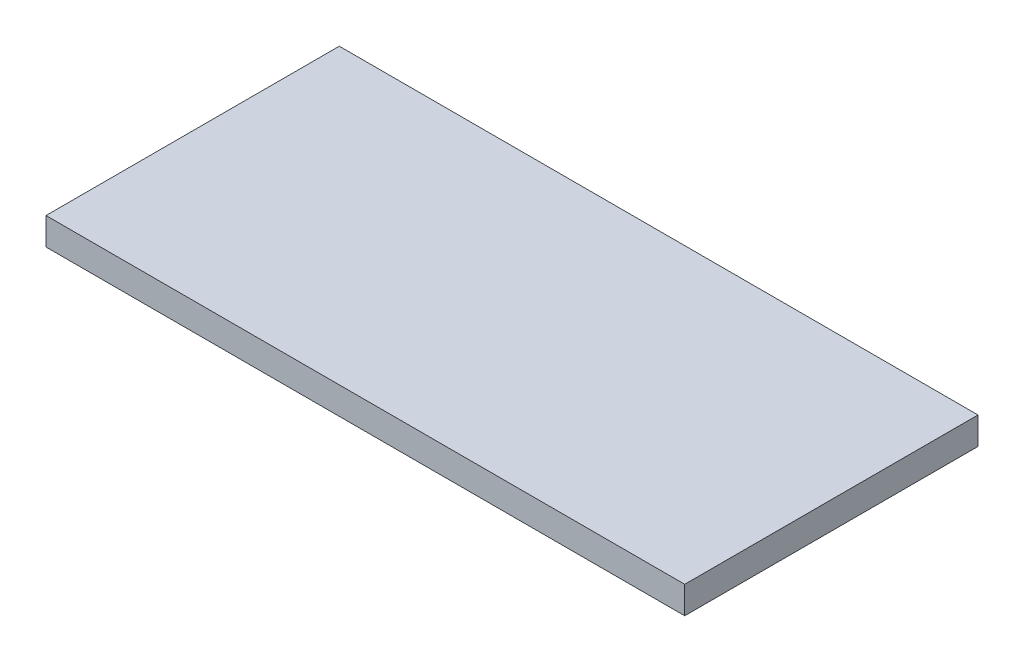
ISO-10303-21;
HEADER;
FILE_DESCRIPTION(('STEP AP214'),'2;1');
FILE_NAME('part.step','',(''),(''),'','','');
FILE_SCHEMA(('AUTOMOTIVE_DESIGN { 1 0 10303 214 1 1 1 1 }'));
ENDSEC;
DATA;
#1=APPLICATION_CONTEXT('core data for automotive mechanical design processes');
#2=APPLICATION_PROTOCOL_DEFINITION('international standard','automotive_design',2000,#1);
#3=PRODUCT_CONTEXT('',#1,'mechanical');
#4=PRODUCT('Part','Part','',(#3));
#5=PRODUCT_RELATED_PRODUCT_CATEGORY('part','',(#4));
#6=PRODUCT_DEFINITION_FORMATION('','',#4);
#7=PRODUCT_DEFINITION_CONTEXT('part definition',#1,'design');
#8=PRODUCT_DEFINITION('design','',#6,#7);
#9=PRODUCT_DEFINITION_SHAPE('','',#8);
#10=(LENGTH_UNIT() NAMED_UNIT(*) SI_UNIT(.MILLI.,.METRE.));
#11=(NAMED_UNIT(*) PLANE_ANGLE_UNIT() SI_UNIT($,.RADIAN.));
#12=(NAMED_UNIT(*) SI_UNIT($,.STERADIAN.) SOLID_ANGLE_UNIT());
#13=UNCERTAINTY_MEASURE_WITH_UNIT(LENGTH_MEASURE(1.E-05),#10,'distance_accuracy_value','');
#14=(GEOMETRIC_REPRESENTATION_CONTEXT(3) GLOBAL_UNCERTAINTY_ASSIGNED_CONTEXT((#13)) GLOBAL_UNIT_ASSIGNED_CONTEXT((#10,
#11,#12)) REPRESENTATION_CONTEXT('',''));
#15=CARTESIAN_POINT('',(0.,0.,0.));
#16=DIRECTION('',(0.,0.,1.));
#17=DIRECTION('',(1.,0.,0.));
#18=AXIS2_PLACEMENT_3D('',#15,#16,#17);
#19=CARTESIAN_POINT('',(0.,1.56,0.));
#20=DIRECTION('',(0.,0.,-1.));
#21=DIRECTION('',(-1.,0.,0.));
#22=AXIS2_PLACEMENT_3D('',#19,#20,#21);
#23=PLANE('',#22);
#24=DIRECTION('',(1.,0.,0.));
#25=VECTOR('',#24,1.);
#26=CARTESIAN_POINT('',(0.,0.,0.));
#27=LINE('',#26,#25);
#28=CARTESIAN_POINT('',(0.,0.,0.));
#29=VERTEX_POINT('',#28);
#30=CARTESIAN_POINT('',(36.5,0.,0.));
#31=VERTEX_POINT('',#30);
#32=EDGE_CURVE('E96',#29,#31,#27,.T.);
#33=ORIENTED_EDGE('',*,*,#32,.T.);
#34=DIRECTION('',(0.,-1.,0.));
#35=VECTOR('',#34,1.);
#36=CARTESIAN_POINT('',(36.5,1.56,0.));
#37=LINE('',#36,#35);
#38=CARTESIAN_POINT('',(36.5,1.56,0.));
#39=VERTEX_POINT('',#38);
#40=EDGE_CURVE('E11',#39,#31,#37,.T.);
#41=ORIENTED_EDGE('',*,*,#40,.F.);
#42=DIRECTION('',(1.,0.,0.));
#43=VECTOR('',#42,1.);
#44=CARTESIAN_POINT('',(0.,1.56,0.));
#45=LINE('',#44,#43);
#46=CARTESIAN_POINT('',(0.,1.56,0.));
#47=VERTEX_POINT('',#46);
#48=EDGE_CURVE('E82',#47,#39,#45,.T.);
#49=ORIENTED_EDGE('',*,*,#48,.F.);
#50=DIRECTION('',(0.,-1.,0.));
#51=VECTOR('',#50,1.);
#52=CARTESIAN_POINT('',(0.,1.56,0.));
#53=LINE('',#52,#51);
#54=EDGE_CURVE('E49',#47,#29,#53,.T.);
#55=ORIENTED_EDGE('',*,*,#54,.T.);
#56=EDGE_LOOP('',(#33,#41,#49,#55));
#57=FACE_BOUND('',#56,.T.);
#58=ADVANCED_FACE('F33',(#57),#23,.F.);
#59=CARTESIAN_POINT('',(36.5,1.56,0.));
#60=DIRECTION('',(-1.,0.,0.));
#61=DIRECTION('',(0.,0.,1.));
#62=AXIS2_PLACEMENT_3D('',#59,#60,#61);
#63=PLANE('',#62);
#64=DIRECTION('',(0.,0.,-1.));
#65=VECTOR('',#64,1.);
#66=CARTESIAN_POINT('',(36.5,0.,0.));
#67=LINE('',#66,#65);
#68=CARTESIAN_POINT('',(36.5,0.,-16.76));
#69=VERTEX_POINT('',#68);
#70=EDGE_CURVE('E87',#31,#69,#67,.T.);
#71=ORIENTED_EDGE('',*,*,#70,.T.);
#72=DIRECTION('',(0.,-1.,0.));
#73=VECTOR('',#72,1.);
#74=CARTESIAN_POINT('',(36.5,1.56,-16.76));
#75=LINE('',#74,#73);
#76=CARTESIAN_POINT('',(36.5,1.56,-16.76));
#77=VERTEX_POINT('',#76);
#78=EDGE_CURVE('E41',#77,#69,#75,.T.);
#79=ORIENTED_EDGE('',*,*,#78,.F.);
#80=DIRECTION('',(0.,0.,-1.));
#81=VECTOR('',#80,1.);
#82=CARTESIAN_POINT('',(36.5,1.56,0.));
#83=LINE('',#82,#81);
#84=EDGE_CURVE('E74',#39,#77,#83,.T.);
#85=ORIENTED_EDGE('',*,*,#84,.F.);
#86=ORIENTED_EDGE('',*,*,#40,.T.);
#87=EDGE_LOOP('',(#71,#79,#85,#86));
#88=FACE_BOUND('',#87,.T.);
#89=ADVANCED_FACE('F86',(#88),#63,.F.);
#90=CARTESIAN_POINT('',(0.,1.56,-16.76));
#91=DIRECTION('',(0.,0.,-1.));
#92=DIRECTION('',(-1.,0.,0.));
#93=AXIS2_PLACEMENT_3D('',#90,#91,#92);
#94=PLANE('',#93);
#95=DIRECTION('',(1.,0.,0.));
#96=VECTOR('',#95,1.);
#97=CARTESIAN_POINT('',(0.,0.,-16.76));
#98=LINE('',#97,#96);
#99=CARTESIAN_POINT('',(0.,0.,-16.76));
#100=VERTEX_POINT('',#99);
#101=EDGE_CURVE('E99',#100,#69,#98,.T.);
#102=ORIENTED_EDGE('',*,*,#101,.F.);
#103=DIRECTION('',(0.,-1.,0.));
#104=VECTOR('',#103,1.);
#105=CARTESIAN_POINT('',(0.,1.56,-16.76));
#106=LINE('',#105,#104);
#107=CARTESIAN_POINT('',(0.,1.56,-16.76));
#108=VERTEX_POINT('',#107);
#109=EDGE_CURVE('E63',#108,#100,#106,.T.);
#110=ORIENTED_EDGE('',*,*,#109,.F.);
#111=DIRECTION('',(1.,0.,0.));
#112=VECTOR('',#111,1.);
#113=CARTESIAN_POINT('',(0.,1.56,-16.76));
#114=LINE('',#113,#112);
#115=EDGE_CURVE('E81',#108,#77,#114,.T.);
#116=ORIENTED_EDGE('',*,*,#115,.T.);
#117=ORIENTED_EDGE('',*,*,#78,.T.);
#118=EDGE_LOOP('',(#102,#110,#116,#117));
#119=FACE_BOUND('',#118,.T.);
#120=ADVANCED_FACE('F90',(#119),#94,.T.);
#121=CARTESIAN_POINT('',(0.,1.56,0.));
#122=DIRECTION('',(-1.,0.,0.));
#123=DIRECTION('',(0.,0.,1.));
#124=AXIS2_PLACEMENT_3D('',#121,#122,#123);
#125=PLANE('',#124);
#126=DIRECTION('',(0.,0.,-1.));
#127=VECTOR('',#126,1.);
#128=CARTESIAN_POINT('',(0.,0.,0.));
#129=LINE('',#128,#127);
#130=EDGE_CURVE('E101',#29,#100,#129,.T.);
#131=ORIENTED_EDGE('',*,*,#130,.F.);
#132=ORIENTED_EDGE('',*,*,#54,.F.);
#133=DIRECTION('',(0.,0.,-1.));
#134=VECTOR('',#133,1.);
#135=CARTESIAN_POINT('',(0.,1.56,0.));
#136=LINE('',#135,#134);
#137=EDGE_CURVE('E91',#47,#108,#136,.T.);
#138=ORIENTED_EDGE('',*,*,#137,.T.);
#139=ORIENTED_EDGE('',*,*,#109,.T.);
#140=EDGE_LOOP('',(#131,#132,#138,#139));
#141=FACE_BOUND('',#140,.T.);
#142=ADVANCED_FACE('F107',(#141),#125,.T.);
#143=CARTESIAN_POINT('',(0.,1.56,0.));
#144=DIRECTION('',(0.,1.,0.));
#145=DIRECTION('',(0.,0.,1.));
#146=AXIS2_PLACEMENT_3D('',#143,#144,#145);
#147=PLANE('',#146);
#148=ORIENTED_EDGE('',*,*,#48,.T.);
#149=ORIENTED_EDGE('',*,*,#84,.T.);
#150=ORIENTED_EDGE('',*,*,#115,.F.);
#151=ORIENTED_EDGE('',*,*,#137,.F.);
#152=EDGE_LOOP('',(#148,#149,#150,#151));
#153=FACE_BOUND('',#152,.T.);
#154=ADVANCED_FACE('F78',(#153),#147,.T.);
#155=CARTESIAN_POINT('',(0.,0.,0.));
#156=DIRECTION('',(0.,1.,0.));
#157=DIRECTION('',(0.,0.,1.));
#158=AXIS2_PLACEMENT_3D('',#155,#156,#157);
#159=PLANE('',#158);
#160=ORIENTED_EDGE('',*,*,#32,.F.);
#161=ORIENTED_EDGE('',*,*,#130,.T.);
#162=ORIENTED_EDGE('',*,*,#101,.T.);
#163=ORIENTED_EDGE('',*,*,#70,.F.);
#164=EDGE_LOOP('',(#160,#161,#162,#163));
#165=FACE_BOUND('',#164,.T.);
#166=ADVANCED_FACE('F106',(#165),#159,.F.);
#167=CLOSED_SHELL('',(#58,#89,#120,#142,#154,#166));
#168=MANIFOLD_SOLID_BREP('B2',#167);
#169=ADVANCED_BREP_SHAPE_REPRESENTATION('',(#18,#168),#14);
#170=SHAPE_DEFINITION_REPRESENTATION(#9,#169);
ENDSEC;
END-ISO-10303-21;
